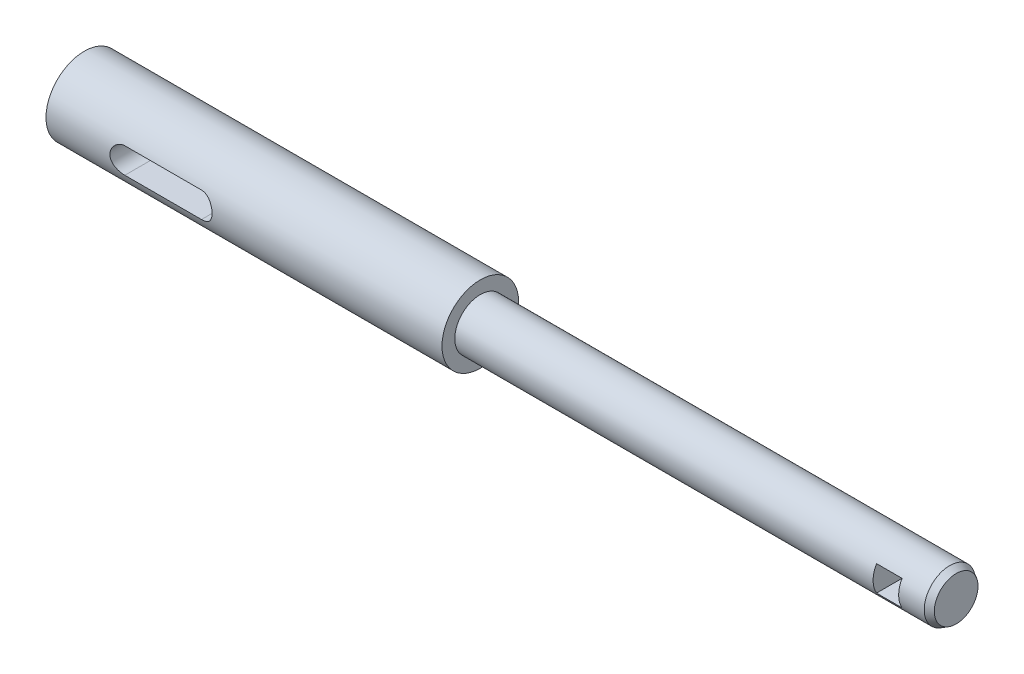
ISO-10303-21;
HEADER;
FILE_DESCRIPTION(('STEP AP214'),'2;1');
FILE_NAME('part.step','',(''),(''),'','','');
FILE_SCHEMA(('AUTOMOTIVE_DESIGN { 1 0 10303 214 1 1 1 1 }'));
ENDSEC;
DATA;
#1=APPLICATION_CONTEXT('core data for automotive mechanical design processes');
#2=APPLICATION_PROTOCOL_DEFINITION('international standard','automotive_design',2000,#1);
#3=PRODUCT_CONTEXT('',#1,'mechanical');
#4=PRODUCT('Part','Part','',(#3));
#5=PRODUCT_RELATED_PRODUCT_CATEGORY('part','',(#4));
#6=PRODUCT_DEFINITION_FORMATION('','',#4);
#7=PRODUCT_DEFINITION_CONTEXT('part definition',#1,'design');
#8=PRODUCT_DEFINITION('design','',#6,#7);
#9=PRODUCT_DEFINITION_SHAPE('','',#8);
#10=(LENGTH_UNIT() NAMED_UNIT(*) SI_UNIT(.MILLI.,.METRE.));
#11=(NAMED_UNIT(*) PLANE_ANGLE_UNIT() SI_UNIT($,.RADIAN.));
#12=(NAMED_UNIT(*) SI_UNIT($,.STERADIAN.) SOLID_ANGLE_UNIT());
#13=UNCERTAINTY_MEASURE_WITH_UNIT(LENGTH_MEASURE(1.E-05),#10,'distance_accuracy_value','');
#14=(GEOMETRIC_REPRESENTATION_CONTEXT(3) GLOBAL_UNCERTAINTY_ASSIGNED_CONTEXT((#13)) GLOBAL_UNIT_ASSIGNED_CONTEXT((#10,
#11,#12)) REPRESENTATION_CONTEXT('',''));
#15=CARTESIAN_POINT('',(0.,0.,0.));
#16=DIRECTION('',(0.,0.,1.));
#17=DIRECTION('',(1.,0.,0.));
#18=AXIS2_PLACEMENT_3D('',#15,#16,#17);
#19=CARTESIAN_POINT('',(31.,12.,0.));
#20=DIRECTION('',(1.,0.,0.));
#21=DIRECTION('',(0.,0.,-1.));
#22=AXIS2_PLACEMENT_3D('',#19,#20,#21);
#23=PLANE('',#22);
#24=CARTESIAN_POINT('',(31.,6.,0.));
#25=DIRECTION('',(1.,0.,0.));
#26=DIRECTION('',(0.,0.,-1.));
#27=AXIS2_PLACEMENT_3D('',#24,#25,#26);
#28=CIRCLE('',#27,4.);
#29=CARTESIAN_POINT('',(31.,6.,-4.));
#30=VERTEX_POINT('',#29);
#31=EDGE_CURVE('E144',#30,#30,#28,.T.);
#32=ORIENTED_EDGE('',*,*,#31,.F.);
#33=EDGE_LOOP('',(#32));
#34=FACE_BOUND('',#33,.T.);
#35=CARTESIAN_POINT('',(31.,6.,0.));
#36=DIRECTION('',(1.,0.,0.));
#37=DIRECTION('',(0.,0.,-1.));
#38=AXIS2_PLACEMENT_3D('',#35,#36,#37);
#39=CIRCLE('',#38,6.);
#40=CARTESIAN_POINT('',(31.,6.,-6.));
#41=VERTEX_POINT('',#40);
#42=EDGE_CURVE('E150',#41,#41,#39,.T.);
#43=ORIENTED_EDGE('',*,*,#42,.T.);
#44=EDGE_LOOP('',(#43));
#45=FACE_BOUND('',#44,.T.);
#46=ADVANCED_FACE('F48',(#34,#45),#23,.T.);
#47=CARTESIAN_POINT('',(105.5,6.,0.));
#48=DIRECTION('',(-1.,0.,0.));
#49=DIRECTION('',(0.,0.,1.));
#50=AXIS2_PLACEMENT_3D('',#47,#48,#49);
#51=CYLINDRICAL_SURFACE('',#50,4.);
#52=CARTESIAN_POINT('',(104.5,6.,0.));
#53=DIRECTION('',(1.,0.,0.));
#54=DIRECTION('',(0.,0.,-1.));
#55=AXIS2_PLACEMENT_3D('',#52,#53,#54);
#56=CIRCLE('',#55,4.);
#57=CARTESIAN_POINT('',(104.5,6.,-4.));
#58=VERTEX_POINT('',#57);
#59=EDGE_CURVE('E12',#58,#58,#56,.F.);
#60=ORIENTED_EDGE('',*,*,#59,.T.);
#61=EDGE_LOOP('',(#60));
#62=FACE_BOUND('',#61,.T.);
#63=DIRECTION('',(-1.,0.,0.));
#64=VECTOR('',#63,1.);
#65=CARTESIAN_POINT('',(105.5,3.99999999999999,-3.46410161513775));
#66=LINE('',#65,#64);
#67=CARTESIAN_POINT('',(96.5,3.99999999999999,-3.46410161513775));
#68=VERTEX_POINT('',#67);
#69=CARTESIAN_POINT('',(100.5,3.99999999999999,-3.46410161513775));
#70=VERTEX_POINT('',#69);
#71=EDGE_CURVE('E237',#68,#70,#66,.F.);
#72=ORIENTED_EDGE('',*,*,#71,.T.);
#73=CARTESIAN_POINT('',(100.5,6.,0.));
#74=DIRECTION('',(1.,0.,0.));
#75=DIRECTION('',(0.,0.,-1.));
#76=AXIS2_PLACEMENT_3D('',#73,#74,#75);
#77=CIRCLE('',#76,4.);
#78=CARTESIAN_POINT('',(100.5,8.00000000000001,-3.46410161513775));
#79=VERTEX_POINT('',#78);
#80=EDGE_CURVE('E234',#70,#79,#77,.T.);
#81=ORIENTED_EDGE('',*,*,#80,.T.);
#82=DIRECTION('',(-1.,0.,0.));
#83=VECTOR('',#82,1.);
#84=CARTESIAN_POINT('',(105.5,8.00000000000001,-3.46410161513775));
#85=LINE('',#84,#83);
#86=CARTESIAN_POINT('',(96.5,8.00000000000001,-3.46410161513775));
#87=VERTEX_POINT('',#86);
#88=EDGE_CURVE('E245',#79,#87,#85,.T.);
#89=ORIENTED_EDGE('',*,*,#88,.T.);
#90=CARTESIAN_POINT('',(96.5,6.,0.));
#91=DIRECTION('',(-1.,0.,0.));
#92=DIRECTION('',(0.,0.,1.));
#93=AXIS2_PLACEMENT_3D('',#90,#91,#92);
#94=CIRCLE('',#93,4.);
#95=EDGE_CURVE('E244',#87,#68,#94,.T.);
#96=ORIENTED_EDGE('',*,*,#95,.T.);
#97=EDGE_LOOP('',(#72,#81,#89,#96));
#98=FACE_BOUND('',#97,.T.);
#99=DIRECTION('',(-1.,0.,0.));
#100=VECTOR('',#99,1.);
#101=CARTESIAN_POINT('',(105.5,8.00000000000001,3.46410161513775));
#102=LINE('',#101,#100);
#103=CARTESIAN_POINT('',(96.5,8.00000000000001,3.46410161513774));
#104=VERTEX_POINT('',#103);
#105=CARTESIAN_POINT('',(100.5,8.00000000000001,3.46410161513775));
#106=VERTEX_POINT('',#105);
#107=EDGE_CURVE('E259',#104,#106,#102,.F.);
#108=ORIENTED_EDGE('',*,*,#107,.T.);
#109=CARTESIAN_POINT('',(100.5,3.99999999999999,3.46410161513774));
#110=VERTEX_POINT('',#109);
#111=EDGE_CURVE('E239',#106,#110,#77,.T.);
#112=ORIENTED_EDGE('',*,*,#111,.T.);
#113=DIRECTION('',(-1.,0.,0.));
#114=VECTOR('',#113,1.);
#115=CARTESIAN_POINT('',(105.5,3.99999999999999,3.46410161513775));
#116=LINE('',#115,#114);
#117=CARTESIAN_POINT('',(96.5,3.99999999999999,3.46410161513775));
#118=VERTEX_POINT('',#117);
#119=EDGE_CURVE('E251',#110,#118,#116,.T.);
#120=ORIENTED_EDGE('',*,*,#119,.T.);
#121=EDGE_CURVE('E255',#118,#104,#94,.T.);
#122=ORIENTED_EDGE('',*,*,#121,.T.);
#123=EDGE_LOOP('',(#108,#112,#120,#122));
#124=FACE_BOUND('',#123,.T.);
#125=ORIENTED_EDGE('',*,*,#31,.T.);
#126=EDGE_LOOP('',(#125));
#127=FACE_BOUND('',#126,.T.);
#128=ADVANCED_FACE('F212',(#62,#98,#124,#127),#51,.T.);
#129=CARTESIAN_POINT('',(105.5,6.,0.));
#130=DIRECTION('',(1.,0.,0.));
#131=DIRECTION('',(0.,0.,-1.));
#132=AXIS2_PLACEMENT_3D('',#129,#130,#131);
#133=PLANE('',#132);
#134=CARTESIAN_POINT('',(105.5,6.,0.));
#135=DIRECTION('',(1.,0.,0.));
#136=DIRECTION('',(0.,0.,-1.));
#137=AXIS2_PLACEMENT_3D('',#134,#135,#136);
#138=CIRCLE('',#137,3.42264973081038);
#139=CARTESIAN_POINT('',(105.5,6.,-3.42264973081038));
#140=VERTEX_POINT('',#139);
#141=EDGE_CURVE('E58',#140,#140,#138,.T.);
#142=ORIENTED_EDGE('',*,*,#141,.T.);
#143=EDGE_LOOP('',(#142));
#144=FACE_BOUND('',#143,.T.);
#145=ADVANCED_FACE('F217',(#144),#133,.T.);
#146=CARTESIAN_POINT('',(105.5,6.,0.));
#147=DIRECTION('',(-1.,0.,0.));
#148=DIRECTION('',(0.,0.,1.));
#149=AXIS2_PLACEMENT_3D('',#146,#147,#148);
#150=CYLINDRICAL_SURFACE('',#149,6.);
#151=CARTESIAN_POINT('',(-17.,6.,6.));
#152=CARTESIAN_POINT('',(-16.9999994925368,6.10912672577345,6.00000030601888));
#153=CARTESIAN_POINT('',(-17.0089605322544,6.2182503890771,5.9969953901509));
#154=CARTESIAN_POINT('',(-17.0444582176344,6.43328352174595,5.98530420406562));
#155=CARTESIAN_POINT('',(-17.0709966878978,6.53919265623764,5.97661734404305));
#156=CARTESIAN_POINT('',(-17.1406384867681,6.74466557900355,5.95450615812885));
#157=CARTESIAN_POINT('',(-17.1837141249186,6.84423965177207,5.94108975461707));
#158=CARTESIAN_POINT('',(-17.2850823456767,7.03474987361065,5.91088891434684));
#159=CARTESIAN_POINT('',(-17.3433779300052,7.12568431391741,5.89410381335556));
#160=CARTESIAN_POINT('',(-17.4756516097175,7.29948335004453,5.8582818888601));
#161=CARTESIAN_POINT('',(-17.550062468521,7.38200740059662,5.8391911292757));
#162=CARTESIAN_POINT('',(-17.7115343094131,7.53366538540417,5.80120629566243));
#163=CARTESIAN_POINT('',(-17.798598069857,7.60279637097892,5.78231226581098));
#164=CARTESIAN_POINT('',(-17.9859702303929,7.72764988445572,5.74626664954548));
#165=CARTESIAN_POINT('',(-18.0865874794642,7.78292971644206,5.72918078551376));
#166=CARTESIAN_POINT('',(-18.2963521889171,7.87563774775544,5.69950610837202));
#167=CARTESIAN_POINT('',(-18.4054970343255,7.91307139477353,5.68691592321491));
#168=CARTESIAN_POINT('',(-18.6253464429934,7.96774692301833,5.66822606538755));
#169=CARTESIAN_POINT('',(-18.7358744169781,7.98562689654354,5.66192191539223));
#170=CARTESIAN_POINT('',(-18.9585275083118,8.00268224666895,5.65591313259015));
#171=CARTESIAN_POINT('',(-19.0706521214184,8.00186340320944,5.6562064604546));
#172=CARTESIAN_POINT('',(-19.287873260888,7.98203980740684,5.6631803001636));
#173=CARTESIAN_POINT('',(-19.393056805838,7.96386782633399,5.66956831735066));
#174=CARTESIAN_POINT('',(-19.5987868392137,7.91121232569883,5.68753315449102));
#175=CARTESIAN_POINT('',(-19.6993327708701,7.87672685318374,5.69911059568215));
#176=CARTESIAN_POINT('',(-19.894825499183,7.79187811612042,5.72635822262498));
#177=CARTESIAN_POINT('',(-19.9896560509391,7.74126809741453,5.74209131586235));
#178=CARTESIAN_POINT('',(-20.1697418165595,7.62577821260628,5.77585117151453));
#179=CARTESIAN_POINT('',(-20.2549942538668,7.56089422472801,5.79387859580927));
#180=CARTESIAN_POINT('',(-20.4181831963216,7.41469866536448,5.83134658335482));
#181=CARTESIAN_POINT('',(-20.4955053890181,7.33270630015263,5.85081178709686));
#182=CARTESIAN_POINT('',(-20.6354625333268,7.15667913994013,5.88813876774073));
#183=CARTESIAN_POINT('',(-20.698096076329,7.06264319132163,5.90600039076135));
#184=CARTESIAN_POINT('',(-20.8073926004701,6.86389522609254,5.93834215875587));
#185=CARTESIAN_POINT('',(-20.8538909826815,6.75908655283268,5.95278700016078));
#186=CARTESIAN_POINT('',(-20.9284063479114,6.54253816672902,5.9764113428887));
#187=CARTESIAN_POINT('',(-20.9564297508469,6.43080087630991,5.98559267309759));
#188=CARTESIAN_POINT('',(-20.9921113320447,6.20876765905861,5.99735254142881));
#189=CARTESIAN_POINT('',(-21.0005996183455,6.0986191997297,6.00020003667456));
#190=CARTESIAN_POINT('',(-20.9993346528031,5.87844986007953,5.99977805389655));
#191=CARTESIAN_POINT('',(-20.9895844800403,5.7684289613607,5.99650960838725));
#192=CARTESIAN_POINT('',(-20.9527761845281,5.55496026739149,5.98440049434209));
#193=CARTESIAN_POINT('',(-20.926227587901,5.45141438633032,5.97572397422385));
#194=CARTESIAN_POINT('',(-20.8572131110665,5.25028808284086,5.9538369366014));
#195=CARTESIAN_POINT('',(-20.8147452010644,5.15270842298279,5.9406258409335));
#196=CARTESIAN_POINT('',(-20.7138591363184,4.96342340721346,5.9105786257458));
#197=CARTESIAN_POINT('',(-20.6550508134337,4.87194008156571,5.89365629511572));
#198=CARTESIAN_POINT('',(-20.523611699973,4.69987033972883,5.85810507832525));
#199=CARTESIAN_POINT('',(-20.4509766879365,4.61928726440885,5.83947567187655));
#200=CARTESIAN_POINT('',(-20.2900424979868,4.46749498438741,5.8015369596089));
#201=CARTESIAN_POINT('',(-20.2011815461463,4.39687806150846,5.78223522174856));
#202=CARTESIAN_POINT('',(-20.0124568643782,4.27148495535285,5.74599946589418));
#203=CARTESIAN_POINT('',(-19.9125930427319,4.21670890413798,5.72906546764005));
#204=CARTESIAN_POINT('',(-19.7046539694202,4.12480613916728,5.69964783582767));
#205=CARTESIAN_POINT('',(-19.5965958416625,4.08764373566996,5.68715521585958));
#206=CARTESIAN_POINT('',(-19.3752426999118,4.03221066648129,5.66821664612899));
#207=CARTESIAN_POINT('',(-19.2619500691913,4.01393149009212,5.66176797247279));
#208=CARTESIAN_POINT('',(-19.0396058079182,3.99744743504532,5.65595717748355));
#209=CARTESIAN_POINT('',(-18.9306353194264,3.9982594853832,5.65624800514831));
#210=CARTESIAN_POINT('',(-18.7144698501559,4.01751541310262,5.66302539647735));
#211=CARTESIAN_POINT('',(-18.6072747640898,4.03595824108283,5.66951159138724));
#212=CARTESIAN_POINT('',(-18.3997286739951,4.08925637374131,5.68769048609784));
#213=CARTESIAN_POINT('',(-18.299286349991,4.12379330796897,5.69928196044955));
#214=CARTESIAN_POINT('',(-18.1055451861235,4.20804126848051,5.72632797636937));
#215=CARTESIAN_POINT('',(-18.012247937624,4.25775566289239,5.74178337526786));
#216=CARTESIAN_POINT('',(-17.8310326601542,4.37347861483314,5.77565658452093));
#217=CARTESIAN_POINT('',(-17.7435269962032,4.44010351447084,5.79417423284274));
#218=CARTESIAN_POINT('',(-17.5806203732316,4.5867142337287,5.83166712566506));
#219=CARTESIAN_POINT('',(-17.5052228486239,4.66670383109704,5.85064249824745));
#220=CARTESIAN_POINT('',(-17.3657111754217,4.84151688615863,5.88780061051088));
#221=CARTESIAN_POINT('',(-17.302151304498,4.93679697300054,5.90592363602513));
#222=CARTESIAN_POINT('',(-17.1920191422987,5.13728528518675,5.93851982345224));
#223=CARTESIAN_POINT('',(-17.1454425081559,5.2424909637353,5.9529939181586));
#224=CARTESIAN_POINT('',(-17.0725567350227,5.45501270559805,5.97611030137084));
#225=CARTESIAN_POINT('',(-17.0454350674732,5.56202448464718,5.98498424845045));
#226=CARTESIAN_POINT('',(-17.0091594386458,5.7793591679795,5.99692814128444));
#227=CARTESIAN_POINT('',(-17.000000513007,5.88968114886251,5.9999996906381));
#228=CARTESIAN_POINT('',(-17.,6.,6.));
#229=B_SPLINE_CURVE_WITH_KNOTS('',3,(#151,#152,#153,#154,#155,#156,#157,#158,#159,#160,#161,
#162,#163,#164,#165,#166,#167,#168,#169,#170,#171,#172,#173,#174,#175,#176,#177,#178,#179,#180,
#181,#182,#183,#184,#185,#186,#187,#188,#189,#190,#191,#192,#193,#194,#195,#196,#197,#198,#199,
#200,#201,#202,#203,#204,#205,#206,#207,#208,#209,#210,#211,#212,#213,#214,#215,#216,#217,#218,
#219,#220,#221,#222,#223,#224,#225,#226,#227,#228),.UNSPECIFIED.,.T.,.F.,(4,2,2,2,2,2,2,2,2,2,2,
2,2,2,2,2,2,2,2,2,2,2,2,2,2,2,2,2,2,2,2,2,2,2,2,2,2,2,4),(0.,0.326974212052022,
0.653982370535038,0.980445345740542,1.3069727555982,1.64369368565512,1.9804886657506,
2.32696769646941,2.67334089385667,3.00803851483679,3.3426326797497,3.6619365310256,
3.98127861710964,4.3057634231026,4.63034205116414,4.97186611622733,5.31342291933236,
5.65836811300714,6.00319337754416,6.33307166350338,6.66289426328352,6.98316315956426,
7.30347290568207,7.63220799687472,7.96104361643781,8.30482045761503,8.64860016469992,
8.99168027653539,9.33460569411679,9.65991332128516,9.9852015870275,10.3043117416083,
10.6234927635195,10.9566013338361,11.2898042224756,11.635993216702,11.9820936230491,
12.3127311674763,12.6432773207628),.UNSPECIFIED.);
#230=CARTESIAN_POINT('',(-19.,8.,5.65685424949238));
#231=VERTEX_POINT('',#230);
#232=CARTESIAN_POINT('',(-18.9999999999992,3.99999999999941,5.65685424949225));
#233=VERTEX_POINT('',#232);
#234=EDGE_CURVE('E127',#231,#233,#229,.T.);
#235=ORIENTED_EDGE('',*,*,#234,.F.);
#236=DIRECTION('',(-1.,0.,0.));
#237=VECTOR('',#236,1.);
#238=CARTESIAN_POINT('',(105.5,8.,5.65685424949238));
#239=LINE('',#238,#237);
#240=CARTESIAN_POINT('',(-7.00000000000001,8.,5.65685424949238));
#241=VERTEX_POINT('',#240);
#242=EDGE_CURVE('E142',#241,#231,#239,.T.);
#243=ORIENTED_EDGE('',*,*,#242,.F.);
#244=CARTESIAN_POINT('',(-5.00000000000004,6.,6.));
#245=CARTESIAN_POINT('',(-4.99999949253675,6.10912672577345,6.00000030601888));
#246=CARTESIAN_POINT('',(-5.00896053225445,6.2182503890771,5.9969953901509));
#247=CARTESIAN_POINT('',(-5.04445821763444,6.43328352174595,5.98530420406562));
#248=CARTESIAN_POINT('',(-5.07099668789785,6.53919265623764,5.97661734404305));
#249=CARTESIAN_POINT('',(-5.14063848676811,6.74466557900355,5.95450615812885));
#250=CARTESIAN_POINT('',(-5.18371412491855,6.84423965177207,5.94108975461707));
#251=CARTESIAN_POINT('',(-5.2850823456767,7.03474987361065,5.91088891434684));
#252=CARTESIAN_POINT('',(-5.34337793000521,7.12568431391741,5.89410381335556));
#253=CARTESIAN_POINT('',(-5.47565160971751,7.29948335004453,5.8582818888601));
#254=CARTESIAN_POINT('',(-5.55006246852099,7.38200740059662,5.8391911292757));
#255=CARTESIAN_POINT('',(-5.71153430941314,7.53366538540417,5.80120629566243));
#256=CARTESIAN_POINT('',(-5.79859806985703,7.60279637097892,5.78231226581098));
#257=CARTESIAN_POINT('',(-5.98597023039292,7.72764988445572,5.74626664954548));
#258=CARTESIAN_POINT('',(-6.08658747946425,7.78292971644206,5.72918078551376));
#259=CARTESIAN_POINT('',(-6.2963521889171,7.87563774775544,5.69950610837202));
#260=CARTESIAN_POINT('',(-6.40549703432549,7.91307139477353,5.68691592321491));
#261=CARTESIAN_POINT('',(-6.62534644299343,7.96774692301833,5.66822606538755));
#262=CARTESIAN_POINT('',(-6.73587441697813,7.98562689654354,5.66192191539223));
#263=CARTESIAN_POINT('',(-6.95852750831177,8.00268224666895,5.65591313259015));
#264=CARTESIAN_POINT('',(-7.07065212141839,8.00186340320944,5.6562064604546));
#265=CARTESIAN_POINT('',(-7.28787326088805,7.98203980740684,5.6631803001636));
#266=CARTESIAN_POINT('',(-7.39305680583804,7.96386782633399,5.66956831735066));
#267=CARTESIAN_POINT('',(-7.59878683921367,7.91121232569883,5.68753315449102));
#268=CARTESIAN_POINT('',(-7.69933277087014,7.87672685318374,5.69911059568215));
#269=CARTESIAN_POINT('',(-7.89482549918296,7.79187811612042,5.72635822262498));
#270=CARTESIAN_POINT('',(-7.98965605093905,7.74126809741453,5.74209131586235));
#271=CARTESIAN_POINT('',(-8.16974181655945,7.62577821260628,5.77585117151453));
#272=CARTESIAN_POINT('',(-8.25499425386677,7.56089422472801,5.79387859580927));
#273=CARTESIAN_POINT('',(-8.41818319632155,7.41469866536448,5.83134658335482));
#274=CARTESIAN_POINT('',(-8.49550538901814,7.33270630015263,5.85081178709686));
#275=CARTESIAN_POINT('',(-8.6354625333268,7.15667913994013,5.88813876774073));
#276=CARTESIAN_POINT('',(-8.69809607632899,7.06264319132163,5.90600039076135));
#277=CARTESIAN_POINT('',(-8.80739260047014,6.86389522609254,5.93834215875587));
#278=CARTESIAN_POINT('',(-8.85389098268147,6.75908655283268,5.95278700016078));
#279=CARTESIAN_POINT('',(-8.92840634791142,6.54253816672902,5.9764113428887));
#280=CARTESIAN_POINT('',(-8.95642975084688,6.43080087630991,5.98559267309759));
#281=CARTESIAN_POINT('',(-8.99211133204472,6.20876765905861,5.99735254142881));
#282=CARTESIAN_POINT('',(-9.00059961834551,6.0986191997297,6.00020003667456));
#283=CARTESIAN_POINT('',(-8.99933465280307,5.87844986007953,5.99977805389655));
#284=CARTESIAN_POINT('',(-8.98958448004025,5.7684289613607,5.99650960838725));
#285=CARTESIAN_POINT('',(-8.95277618452809,5.55496026739149,5.98440049434209));
#286=CARTESIAN_POINT('',(-8.92622758790102,5.45141438633032,5.97572397422385));
#287=CARTESIAN_POINT('',(-8.85721311106655,5.25028808284086,5.9538369366014));
#288=CARTESIAN_POINT('',(-8.81474520106443,5.15270842298279,5.9406258409335));
#289=CARTESIAN_POINT('',(-8.71385913631843,4.96342340721346,5.9105786257458));
#290=CARTESIAN_POINT('',(-8.65505081343366,4.87194008156571,5.89365629511572));
#291=CARTESIAN_POINT('',(-8.52361169997304,4.69987033972883,5.85810507832525));
#292=CARTESIAN_POINT('',(-8.45097668793647,4.61928726440885,5.83947567187655));
#293=CARTESIAN_POINT('',(-8.29004249798683,4.4674949843874,5.8015369596089));
#294=CARTESIAN_POINT('',(-8.20118154614628,4.39687806150846,5.78223522174856));
#295=CARTESIAN_POINT('',(-8.01245686437823,4.27148495535285,5.74599946589418));
#296=CARTESIAN_POINT('',(-7.91259304273186,4.21670890413798,5.72906546764005));
#297=CARTESIAN_POINT('',(-7.70465396942022,4.12480613916728,5.69964783582767));
#298=CARTESIAN_POINT('',(-7.59659584166248,4.08764373566996,5.68715521585958));
#299=CARTESIAN_POINT('',(-7.37524269991175,4.03221066648129,5.66821664612899));
#300=CARTESIAN_POINT('',(-7.26195006919131,4.01393149009212,5.66176797247279));
#301=CARTESIAN_POINT('',(-7.03960580791817,3.99744743504532,5.65595717748355));
#302=CARTESIAN_POINT('',(-6.93063531942636,3.9982594853832,5.65624800514831));
#303=CARTESIAN_POINT('',(-6.71446985015588,4.01751541310262,5.66302539647735));
#304=CARTESIAN_POINT('',(-6.60727476408983,4.03595824108283,5.66951159138724));
#305=CARTESIAN_POINT('',(-6.39972867399506,4.08925637374131,5.68769048609784));
#306=CARTESIAN_POINT('',(-6.29928634999101,4.12379330796897,5.69928196044955));
#307=CARTESIAN_POINT('',(-6.10554518612347,4.20804126848051,5.72632797636937));
#308=CARTESIAN_POINT('',(-6.01224793762399,4.25775566289239,5.74178337526786));
#309=CARTESIAN_POINT('',(-5.83103266015419,4.37347861483314,5.77565658452093));
#310=CARTESIAN_POINT('',(-5.74352699620324,4.44010351447084,5.79417423284274));
#311=CARTESIAN_POINT('',(-5.58062037323161,4.5867142337287,5.83166712566506));
#312=CARTESIAN_POINT('',(-5.50522284862386,4.66670383109704,5.85064249824745));
#313=CARTESIAN_POINT('',(-5.36571117542165,4.84151688615863,5.88780061051088));
#314=CARTESIAN_POINT('',(-5.30215130449801,4.93679697300055,5.90592363602513));
#315=CARTESIAN_POINT('',(-5.19201914229872,5.13728528518675,5.93851982345224));
#316=CARTESIAN_POINT('',(-5.14544250815593,5.2424909637353,5.9529939181586));
#317=CARTESIAN_POINT('',(-5.07255673502266,5.45501270559805,5.97611030137084));
#318=CARTESIAN_POINT('',(-5.04543506747325,5.56202448464718,5.98498424845045));
#319=CARTESIAN_POINT('',(-5.00915943864576,5.7793591679795,5.99692814128444));
#320=CARTESIAN_POINT('',(-5.00000051300696,5.88968114886251,5.9999996906381));
#321=CARTESIAN_POINT('',(-5.00000000000004,6.,6.));
#322=B_SPLINE_CURVE_WITH_KNOTS('',3,(#244,#245,#246,#247,#248,#249,#250,#251,#252,#253,#254,
#255,#256,#257,#258,#259,#260,#261,#262,#263,#264,#265,#266,#267,#268,#269,#270,#271,#272,#273,
#274,#275,#276,#277,#278,#279,#280,#281,#282,#283,#284,#285,#286,#287,#288,#289,#290,#291,#292,
#293,#294,#295,#296,#297,#298,#299,#300,#301,#302,#303,#304,#305,#306,#307,#308,#309,#310,#311,
#312,#313,#314,#315,#316,#317,#318,#319,#320,#321),.UNSPECIFIED.,.T.,.F.,(4,2,2,2,2,2,2,2,2,2,2,
2,2,2,2,2,2,2,2,2,2,2,2,2,2,2,2,2,2,2,2,2,2,2,2,2,2,2,4),(0.,0.326974212052022,
0.653982370535038,0.980445345740542,1.3069727555982,1.64369368565512,1.9804886657506,
2.3269676964694,2.67334089385666,3.0080385148368,3.3426326797497,3.6619365310256,
3.98127861710963,4.30576342310261,4.63034205116414,4.97186611622733,5.31342291933236,
5.65836811300714,6.00319337754416,6.33307166350338,6.66289426328352,6.98316315956426,
7.30347290568207,7.63220799687472,7.96104361643781,8.30482045761503,8.64860016469992,
8.9916802765354,9.33460569411679,9.65991332128515,9.98520158702749,10.3043117416083,
10.6234927635195,10.9566013338361,11.2898042224756,11.635993216702,11.9820936230491,
12.3127311674763,12.6432773207628),.UNSPECIFIED.);
#323=CARTESIAN_POINT('',(-7.00000000000001,4.,5.65685424949238));
#324=VERTEX_POINT('',#323);
#325=EDGE_CURVE('E132',#324,#241,#322,.T.);
#326=ORIENTED_EDGE('',*,*,#325,.F.);
#327=DIRECTION('',(-1.,0.,0.));
#328=VECTOR('',#327,1.);
#329=CARTESIAN_POINT('',(105.5,4.,5.65685424949238));
#330=LINE('',#329,#328);
#331=EDGE_CURVE('E114',#233,#324,#330,.F.);
#332=ORIENTED_EDGE('',*,*,#331,.F.);
#333=EDGE_LOOP('',(#235,#243,#326,#332));
#334=FACE_BOUND('',#333,.T.);
#335=DIRECTION('',(-1.,0.,0.));
#336=VECTOR('',#335,1.);
#337=CARTESIAN_POINT('',(105.5,4.,-5.65685424949238));
#338=LINE('',#337,#336);
#339=CARTESIAN_POINT('',(-7.00000000000001,4.,-5.65685424949238));
#340=VERTEX_POINT('',#339);
#341=CARTESIAN_POINT('',(-19.,4.,-5.65685424949238));
#342=VERTEX_POINT('',#341);
#343=EDGE_CURVE('E186',#340,#342,#338,.T.);
#344=ORIENTED_EDGE('',*,*,#343,.F.);
#345=CARTESIAN_POINT('',(-5.00000000000001,6.,-6.));
#346=CARTESIAN_POINT('',(-4.99999949253673,5.89087327422656,-6.00000030601888));
#347=CARTESIAN_POINT('',(-5.00896053225444,5.7817496109229,-5.9969953901509));
#348=CARTESIAN_POINT('',(-5.04445821763445,5.56671647825406,-5.98530420406562));
#349=CARTESIAN_POINT('',(-5.07099668789785,5.46080734376237,-5.97661734404305));
#350=CARTESIAN_POINT('',(-5.1406384867681,5.25533442099645,-5.95450615812885));
#351=CARTESIAN_POINT('',(-5.18371412491855,5.15576034822793,-5.94108975461707));
#352=CARTESIAN_POINT('',(-5.2850823456767,4.96525012638935,-5.91088891434684));
#353=CARTESIAN_POINT('',(-5.34337793000521,4.87431568608259,-5.89410381335556));
#354=CARTESIAN_POINT('',(-5.47565160971751,4.70051664995547,-5.8582818888601));
#355=CARTESIAN_POINT('',(-5.55006246852099,4.61799259940338,-5.8391911292757));
#356=CARTESIAN_POINT('',(-5.71153430941314,4.46633461459584,-5.80120629566243));
#357=CARTESIAN_POINT('',(-5.79859806985703,4.39720362902108,-5.78231226581098));
#358=CARTESIAN_POINT('',(-5.98597023039293,4.27235011554429,-5.74626664954548));
#359=CARTESIAN_POINT('',(-6.08658747946425,4.21707028355794,-5.72918078551376));
#360=CARTESIAN_POINT('',(-6.2963521889171,4.12436225224456,-5.69950610837202));
#361=CARTESIAN_POINT('',(-6.40549703432549,4.08692860522647,-5.68691592321491));
#362=CARTESIAN_POINT('',(-6.62534644299343,4.03225307698168,-5.66822606538755));
#363=CARTESIAN_POINT('',(-6.73587441697814,4.01437310345646,-5.66192191539223));
#364=CARTESIAN_POINT('',(-6.95852750831177,3.99731775333105,-5.65591313259015));
#365=CARTESIAN_POINT('',(-7.07065212141839,3.99813659679057,-5.6562064604546));
#366=CARTESIAN_POINT('',(-7.28787326088805,4.01796019259317,-5.66318030016361));
#367=CARTESIAN_POINT('',(-7.39305680583804,4.03613217366602,-5.66956831735066));
#368=CARTESIAN_POINT('',(-7.59878683921368,4.08878767430117,-5.68753315449102));
#369=CARTESIAN_POINT('',(-7.69933277087015,4.12327314681626,-5.69911059568215));
#370=CARTESIAN_POINT('',(-7.89482549918296,4.20812188387958,-5.72635822262498));
#371=CARTESIAN_POINT('',(-7.98965605093906,4.25873190258548,-5.74209131586235));
#372=CARTESIAN_POINT('',(-8.16974181655946,4.37422178739373,-5.77585117151453));
#373=CARTESIAN_POINT('',(-8.25499425386677,4.43910577527199,-5.79387859580927));
#374=CARTESIAN_POINT('',(-8.41818319632155,4.58530133463553,-5.83134658335482));
#375=CARTESIAN_POINT('',(-8.49550538901815,4.66729369984738,-5.85081178709686));
#376=CARTESIAN_POINT('',(-8.6354625333268,4.84332086005988,-5.88813876774073));
#377=CARTESIAN_POINT('',(-8.698096076329,4.93735680867837,-5.90600039076135));
#378=CARTESIAN_POINT('',(-8.80739260047014,5.13610477390747,-5.93834215875587));
#379=CARTESIAN_POINT('',(-8.85389098268147,5.24091344716733,-5.95278700016079));
#380=CARTESIAN_POINT('',(-8.92840634791143,5.45746183327099,-5.9764113428887));
#381=CARTESIAN_POINT('',(-8.95642975084688,5.56919912369009,-5.98559267309759));
#382=CARTESIAN_POINT('',(-8.99211133204472,5.79123234094139,-5.99735254142881));
#383=CARTESIAN_POINT('',(-9.00059961834551,5.90138080027031,-6.00020003667456));
#384=CARTESIAN_POINT('',(-8.99933465280307,6.12155013992048,-5.99977805389655));
#385=CARTESIAN_POINT('',(-8.98958448004025,6.2315710386393,-5.99650960838725));
#386=CARTESIAN_POINT('',(-8.95277618452809,6.44503973260851,-5.98440049434209));
#387=CARTESIAN_POINT('',(-8.92622758790102,6.54858561366969,-5.97572397422385));
#388=CARTESIAN_POINT('',(-8.85721311106655,6.74971191715915,-5.9538369366014));
#389=CARTESIAN_POINT('',(-8.81474520106443,6.84729157701722,-5.9406258409335));
#390=CARTESIAN_POINT('',(-8.71385913631843,7.03657659278655,-5.91057862574579));
#391=CARTESIAN_POINT('',(-8.65505081343366,7.1280599184343,-5.89365629511572));
#392=CARTESIAN_POINT('',(-8.52361169997304,7.30012966027118,-5.85810507832525));
#393=CARTESIAN_POINT('',(-8.45097668793647,7.38071273559116,-5.83947567187655));
#394=CARTESIAN_POINT('',(-8.29004249798683,7.5325050156126,-5.80153695960889));
#395=CARTESIAN_POINT('',(-8.20118154614628,7.60312193849154,-5.78223522174856));
#396=CARTESIAN_POINT('',(-8.01245686437823,7.72851504464715,-5.74599946589417));
#397=CARTESIAN_POINT('',(-7.91259304273185,7.78329109586203,-5.72906546764005));
#398=CARTESIAN_POINT('',(-7.70465396942021,7.87519386083272,-5.69964783582767));
#399=CARTESIAN_POINT('',(-7.59659584166247,7.91235626433004,-5.68715521585958));
#400=CARTESIAN_POINT('',(-7.37524269991174,7.96778933351871,-5.66821664612899));
#401=CARTESIAN_POINT('',(-7.26195006919131,7.98606850990788,-5.66176797247279));
#402=CARTESIAN_POINT('',(-7.03960580791817,8.00255256495469,-5.65595717748354));
#403=CARTESIAN_POINT('',(-6.93063531942636,8.0017405146168,-5.6562480051483));
#404=CARTESIAN_POINT('',(-6.71446985015588,7.98248458689738,-5.66302539647735));
#405=CARTESIAN_POINT('',(-6.60727476408983,7.96404175891717,-5.66951159138723));
#406=CARTESIAN_POINT('',(-6.39972867399506,7.91074362625869,-5.68769048609783));
#407=CARTESIAN_POINT('',(-6.29928634999101,7.87620669203103,-5.69928196044955));
#408=CARTESIAN_POINT('',(-6.10554518612347,7.79195873151949,-5.72632797636937));
#409=CARTESIAN_POINT('',(-6.01224793762399,7.74224433710761,-5.74178337526786));
#410=CARTESIAN_POINT('',(-5.83103266015418,7.62652138516686,-5.77565658452093));
#411=CARTESIAN_POINT('',(-5.74352699620323,7.55989648552916,-5.79417423284274));
#412=CARTESIAN_POINT('',(-5.58062037323161,7.4132857662713,-5.83166712566506));
#413=CARTESIAN_POINT('',(-5.50522284862386,7.33329616890296,-5.85064249824745));
#414=CARTESIAN_POINT('',(-5.36571117542165,7.15848311384138,-5.88780061051088));
#415=CARTESIAN_POINT('',(-5.30215130449801,7.06320302699946,-5.90592363602513));
#416=CARTESIAN_POINT('',(-5.19201914229872,6.86271471481325,-5.93851982345224));
#417=CARTESIAN_POINT('',(-5.14544250815592,6.7575090362647,-5.9529939181586));
#418=CARTESIAN_POINT('',(-5.07255673502266,6.54498729440195,-5.97611030137084));
#419=CARTESIAN_POINT('',(-5.04543506747326,6.43797551535282,-5.98498424845045));
#420=CARTESIAN_POINT('',(-5.00915943864576,6.2206408320205,-5.99692814128444));
#421=CARTESIAN_POINT('',(-5.00000051300693,6.1103188511375,-5.9999996906381));
#422=CARTESIAN_POINT('',(-5.00000000000001,6.,-6.));
#423=B_SPLINE_CURVE_WITH_KNOTS('',3,(#345,#346,#347,#348,#349,#350,#351,#352,#353,#354,#355,
#356,#357,#358,#359,#360,#361,#362,#363,#364,#365,#366,#367,#368,#369,#370,#371,#372,#373,#374,
#375,#376,#377,#378,#379,#380,#381,#382,#383,#384,#385,#386,#387,#388,#389,#390,#391,#392,#393,
#394,#395,#396,#397,#398,#399,#400,#401,#402,#403,#404,#405,#406,#407,#408,#409,#410,#411,#412,
#413,#414,#415,#416,#417,#418,#419,#420,#421,#422),.UNSPECIFIED.,.T.,.F.,(4,2,2,2,2,2,2,2,2,2,2,
2,2,2,2,2,2,2,2,2,2,2,2,2,2,2,2,2,2,2,2,2,2,2,2,2,2,2,4),(0.,0.326974212052022,
0.653982370535041,0.980445345740548,1.3069727555982,1.64369368565512,1.9804886657506,
2.32696769646941,2.67334089385666,3.0080385148368,3.34263267974971,3.6619365310256,
3.98127861710964,4.30576342310261,4.63034205116414,4.97186611622734,5.31342291933236,
5.65836811300715,6.00319337754416,6.33307166350339,6.66289426328353,6.98316315956427,
7.30347290568207,7.63220799687473,7.96104361643782,8.30482045761504,8.64860016469993,
8.9916802765354,9.3346056941168,9.65991332128516,9.9852015870275,10.3043117416083,
10.6234927635195,10.9566013338361,11.2898042224756,11.635993216702,11.9820936230491,
12.3127311674763,12.6432773207628),.UNSPECIFIED.);
#424=CARTESIAN_POINT('',(-7.00000000000001,8.,-5.65685424949238));
#425=VERTEX_POINT('',#424);
#426=EDGE_CURVE('E126',#425,#340,#423,.T.);
#427=ORIENTED_EDGE('',*,*,#426,.F.);
#428=DIRECTION('',(-1.,0.,0.));
#429=VECTOR('',#428,1.);
#430=CARTESIAN_POINT('',(105.5,8.,-5.65685424949238));
#431=LINE('',#430,#429);
#432=CARTESIAN_POINT('',(-19.,8.,-5.65685424949238));
#433=VERTEX_POINT('',#432);
#434=EDGE_CURVE('E177',#433,#425,#431,.F.);
#435=ORIENTED_EDGE('',*,*,#434,.F.);
#436=CARTESIAN_POINT('',(-17.,6.,-6.));
#437=CARTESIAN_POINT('',(-16.9999994925367,5.89087327422656,-6.00000030601888));
#438=CARTESIAN_POINT('',(-17.0089605322544,5.7817496109229,-5.9969953901509));
#439=CARTESIAN_POINT('',(-17.0444582176344,5.56671647825406,-5.98530420406562));
#440=CARTESIAN_POINT('',(-17.0709966878978,5.46080734376237,-5.97661734404305));
#441=CARTESIAN_POINT('',(-17.1406384867681,5.25533442099645,-5.95450615812885));
#442=CARTESIAN_POINT('',(-17.1837141249186,5.15576034822794,-5.94108975461707));
#443=CARTESIAN_POINT('',(-17.2850823456767,4.96525012638936,-5.91088891434684));
#444=CARTESIAN_POINT('',(-17.3433779300052,4.87431568608259,-5.89410381335556));
#445=CARTESIAN_POINT('',(-17.4756516097175,4.70051664995547,-5.8582818888601));
#446=CARTESIAN_POINT('',(-17.550062468521,4.61799259940338,-5.8391911292757));
#447=CARTESIAN_POINT('',(-17.7115343094131,4.46633461459584,-5.80120629566243));
#448=CARTESIAN_POINT('',(-17.798598069857,4.39720362902108,-5.78231226581098));
#449=CARTESIAN_POINT('',(-17.9859702303929,4.27235011554429,-5.74626664954548));
#450=CARTESIAN_POINT('',(-18.0865874794642,4.21707028355794,-5.72918078551377));
#451=CARTESIAN_POINT('',(-18.2963521889171,4.12436225224456,-5.69950610837202));
#452=CARTESIAN_POINT('',(-18.4054970343255,4.08692860522647,-5.68691592321491));
#453=CARTESIAN_POINT('',(-18.6253464429934,4.03225307698168,-5.66822606538755));
#454=CARTESIAN_POINT('',(-18.7358744169781,4.01437310345646,-5.66192191539223));
#455=CARTESIAN_POINT('',(-18.9585275083118,3.99731775333105,-5.65591313259015));
#456=CARTESIAN_POINT('',(-19.0706521214184,3.99813659679057,-5.6562064604546));
#457=CARTESIAN_POINT('',(-19.287873260888,4.01796019259317,-5.66318030016361));
#458=CARTESIAN_POINT('',(-19.393056805838,4.03613217366601,-5.66956831735066));
#459=CARTESIAN_POINT('',(-19.5987868392137,4.08878767430117,-5.68753315449102));
#460=CARTESIAN_POINT('',(-19.6993327708701,4.12327314681626,-5.69911059568215));
#461=CARTESIAN_POINT('',(-19.894825499183,4.20812188387958,-5.72635822262498));
#462=CARTESIAN_POINT('',(-19.9896560509391,4.25873190258548,-5.74209131586235));
#463=CARTESIAN_POINT('',(-20.1697418165595,4.37422178739372,-5.77585117151453));
#464=CARTESIAN_POINT('',(-20.2549942538668,4.43910577527199,-5.79387859580927));
#465=CARTESIAN_POINT('',(-20.4181831963216,4.58530133463553,-5.83134658335482));
#466=CARTESIAN_POINT('',(-20.4955053890181,4.66729369984738,-5.85081178709686));
#467=CARTESIAN_POINT('',(-20.6354625333268,4.84332086005988,-5.88813876774073));
#468=CARTESIAN_POINT('',(-20.698096076329,4.93735680867837,-5.90600039076135));
#469=CARTESIAN_POINT('',(-20.8073926004701,5.13610477390747,-5.93834215875587));
#470=CARTESIAN_POINT('',(-20.8538909826815,5.24091344716733,-5.95278700016079));
#471=CARTESIAN_POINT('',(-20.9284063479114,5.45746183327099,-5.9764113428887));
#472=CARTESIAN_POINT('',(-20.9564297508469,5.56919912369009,-5.98559267309759));
#473=CARTESIAN_POINT('',(-20.9921113320447,5.79123234094139,-5.99735254142881));
#474=CARTESIAN_POINT('',(-21.0005996183455,5.90138080027031,-6.00020003667456));
#475=CARTESIAN_POINT('',(-20.9993346528031,6.12155013992048,-5.99977805389655));
#476=CARTESIAN_POINT('',(-20.9895844800403,6.2315710386393,-5.99650960838725));
#477=CARTESIAN_POINT('',(-20.9527761845281,6.44503973260851,-5.98440049434209));
#478=CARTESIAN_POINT('',(-20.926227587901,6.54858561366969,-5.97572397422385));
#479=CARTESIAN_POINT('',(-20.8572131110665,6.74971191715915,-5.9538369366014));
#480=CARTESIAN_POINT('',(-20.8147452010644,6.84729157701721,-5.9406258409335));
#481=CARTESIAN_POINT('',(-20.7138591363184,7.03657659278655,-5.91057862574579));
#482=CARTESIAN_POINT('',(-20.6550508134337,7.1280599184343,-5.89365629511572));
#483=CARTESIAN_POINT('',(-20.523611699973,7.30012966027117,-5.85810507832525));
#484=CARTESIAN_POINT('',(-20.4509766879365,7.38071273559115,-5.83947567187655));
#485=CARTESIAN_POINT('',(-20.2900424979868,7.5325050156126,-5.8015369596089));
#486=CARTESIAN_POINT('',(-20.2011815461463,7.60312193849154,-5.78223522174856));
#487=CARTESIAN_POINT('',(-20.0124568643782,7.72851504464715,-5.74599946589417));
#488=CARTESIAN_POINT('',(-19.9125930427319,7.78329109586203,-5.72906546764005));
#489=CARTESIAN_POINT('',(-19.7046539694202,7.87519386083272,-5.69964783582767));
#490=CARTESIAN_POINT('',(-19.5965958416625,7.91235626433004,-5.68715521585958));
#491=CARTESIAN_POINT('',(-19.3752426999117,7.96778933351871,-5.66821664612899));
#492=CARTESIAN_POINT('',(-19.2619500691913,7.98606850990788,-5.66176797247279));
#493=CARTESIAN_POINT('',(-19.0396058079182,8.00255256495469,-5.65595717748354));
#494=CARTESIAN_POINT('',(-18.9306353194264,8.0017405146168,-5.6562480051483));
#495=CARTESIAN_POINT('',(-18.7144698501559,7.98248458689738,-5.66302539647735));
#496=CARTESIAN_POINT('',(-18.6072747640898,7.96404175891717,-5.66951159138723));
#497=CARTESIAN_POINT('',(-18.3997286739951,7.91074362625869,-5.68769048609783));
#498=CARTESIAN_POINT('',(-18.299286349991,7.87620669203103,-5.69928196044955));
#499=CARTESIAN_POINT('',(-18.1055451861235,7.79195873151949,-5.72632797636937));
#500=CARTESIAN_POINT('',(-18.012247937624,7.74224433710761,-5.74178337526786));
#501=CARTESIAN_POINT('',(-17.8310326601542,7.62652138516686,-5.77565658452092));
#502=CARTESIAN_POINT('',(-17.7435269962032,7.55989648552916,-5.79417423284274));
#503=CARTESIAN_POINT('',(-17.5806203732316,7.4132857662713,-5.83166712566506));
#504=CARTESIAN_POINT('',(-17.5052228486239,7.33329616890297,-5.85064249824745));
#505=CARTESIAN_POINT('',(-17.3657111754217,7.15848311384138,-5.88780061051088));
#506=CARTESIAN_POINT('',(-17.302151304498,7.06320302699946,-5.90592363602513));
#507=CARTESIAN_POINT('',(-17.1920191422987,6.86271471481325,-5.93851982345224));
#508=CARTESIAN_POINT('',(-17.1454425081559,6.7575090362647,-5.9529939181586));
#509=CARTESIAN_POINT('',(-17.0725567350227,6.54498729440195,-5.97611030137084));
#510=CARTESIAN_POINT('',(-17.0454350674733,6.43797551535282,-5.98498424845045));
#511=CARTESIAN_POINT('',(-17.0091594386458,6.2206408320205,-5.99692814128444));
#512=CARTESIAN_POINT('',(-17.0000005130069,6.1103188511375,-5.9999996906381));
#513=CARTESIAN_POINT('',(-17.,6.,-6.));
#514=B_SPLINE_CURVE_WITH_KNOTS('',3,(#436,#437,#438,#439,#440,#441,#442,#443,#444,#445,#446,
#447,#448,#449,#450,#451,#452,#453,#454,#455,#456,#457,#458,#459,#460,#461,#462,#463,#464,#465,
#466,#467,#468,#469,#470,#471,#472,#473,#474,#475,#476,#477,#478,#479,#480,#481,#482,#483,#484,
#485,#486,#487,#488,#489,#490,#491,#492,#493,#494,#495,#496,#497,#498,#499,#500,#501,#502,#503,
#504,#505,#506,#507,#508,#509,#510,#511,#512,#513),.UNSPECIFIED.,.T.,.F.,(4,2,2,2,2,2,2,2,2,2,2,
2,2,2,2,2,2,2,2,2,2,2,2,2,2,2,2,2,2,2,2,2,2,2,2,2,2,2,4),(0.,0.326974212052021,0.65398237053504,
0.980445345740546,1.3069727555982,1.64369368565512,1.9804886657506,2.32696769646941,
2.67334089385667,3.0080385148368,3.34263267974971,3.6619365310256,3.98127861710964,
4.30576342310261,4.63034205116414,4.97186611622734,5.31342291933236,5.65836811300715,
6.00319337754416,6.33307166350339,6.66289426328352,6.98316315956426,7.30347290568207,
7.63220799687473,7.96104361643782,8.30482045761503,8.64860016469992,8.9916802765354,
9.3346056941168,9.65991332128516,9.9852015870275,10.3043117416083,10.6234927635195,
10.9566013338361,11.2898042224756,11.635993216702,11.9820936230491,12.3127311674763,
12.6432773207628),.UNSPECIFIED.);
#515=EDGE_CURVE('E180',#342,#433,#514,.T.);
#516=ORIENTED_EDGE('',*,*,#515,.F.);
#517=EDGE_LOOP('',(#344,#427,#435,#516));
#518=FACE_BOUND('',#517,.T.);
#519=CARTESIAN_POINT('',(-31.,6.,0.));
#520=DIRECTION('',(-1.,0.,0.));
#521=DIRECTION('',(0.,0.,1.));
#522=AXIS2_PLACEMENT_3D('',#519,#520,#521);
#523=CIRCLE('',#522,6.);
#524=CARTESIAN_POINT('',(-31.,6.,6.));
#525=VERTEX_POINT('',#524);
#526=EDGE_CURVE('E283',#525,#525,#523,.T.);
#527=ORIENTED_EDGE('',*,*,#526,.F.);
#528=EDGE_LOOP('',(#527));
#529=FACE_BOUND('',#528,.T.);
#530=ORIENTED_EDGE('',*,*,#42,.F.);
#531=EDGE_LOOP('',(#530));
#532=FACE_BOUND('',#531,.T.);
#533=ADVANCED_FACE('F139',(#334,#518,#529,#532),#150,.T.);
#534=CARTESIAN_POINT('',(-31.,12.,0.));
#535=DIRECTION('',(1.,0.,0.));
#536=DIRECTION('',(0.,0.,-1.));
#537=AXIS2_PLACEMENT_3D('',#534,#535,#536);
#538=PLANE('',#537);
#539=ORIENTED_EDGE('',*,*,#526,.T.);
#540=EDGE_LOOP('',(#539));
#541=FACE_BOUND('',#540,.T.);
#542=ADVANCED_FACE('F192',(#541),#538,.F.);
#543=CARTESIAN_POINT('',(-19.,6.,-6.));
#544=DIRECTION('',(0.,0.,1.));
#545=DIRECTION('',(1.,0.,0.));
#546=AXIS2_PLACEMENT_3D('',#543,#544,#545);
#547=CYLINDRICAL_SURFACE('',#546,2.);
#548=DIRECTION('',(0.,0.,1.));
#549=VECTOR('',#548,1.);
#550=CARTESIAN_POINT('',(-19.,8.,-6.));
#551=LINE('',#550,#549);
#552=EDGE_CURVE('E286',#433,#231,#551,.T.);
#553=ORIENTED_EDGE('',*,*,#552,.T.);
#554=ORIENTED_EDGE('',*,*,#234,.T.);
#555=DIRECTION('',(0.,0.,1.));
#556=VECTOR('',#555,1.);
#557=CARTESIAN_POINT('',(-19.,4.,-6.));
#558=LINE('',#557,#556);
#559=EDGE_CURVE('E121',#342,#233,#558,.T.);
#560=ORIENTED_EDGE('',*,*,#559,.F.);
#561=ORIENTED_EDGE('',*,*,#515,.T.);
#562=EDGE_LOOP('',(#553,#554,#560,#561));
#563=FACE_BOUND('',#562,.T.);
#564=ADVANCED_FACE('F188',(#563),#547,.F.);
#565=CARTESIAN_POINT('',(-19.,8.,-6.));
#566=DIRECTION('',(0.,1.,0.));
#567=DIRECTION('',(0.,0.,1.));
#568=AXIS2_PLACEMENT_3D('',#565,#566,#567);
#569=PLANE('',#568);
#570=ORIENTED_EDGE('',*,*,#434,.T.);
#571=DIRECTION('',(0.,0.,1.));
#572=VECTOR('',#571,1.);
#573=CARTESIAN_POINT('',(-7.00000000000001,8.,-6.));
#574=LINE('',#573,#572);
#575=EDGE_CURVE('E136',#425,#241,#574,.T.);
#576=ORIENTED_EDGE('',*,*,#575,.T.);
#577=ORIENTED_EDGE('',*,*,#242,.T.);
#578=ORIENTED_EDGE('',*,*,#552,.F.);
#579=EDGE_LOOP('',(#570,#576,#577,#578));
#580=FACE_BOUND('',#579,.T.);
#581=ADVANCED_FACE('F169',(#580),#569,.F.);
#582=CARTESIAN_POINT('',(-7.00000000000001,6.,-6.));
#583=DIRECTION('',(0.,0.,1.));
#584=DIRECTION('',(1.,0.,0.));
#585=AXIS2_PLACEMENT_3D('',#582,#583,#584);
#586=CYLINDRICAL_SURFACE('',#585,2.);
#587=ORIENTED_EDGE('',*,*,#325,.T.);
#588=ORIENTED_EDGE('',*,*,#575,.F.);
#589=ORIENTED_EDGE('',*,*,#426,.T.);
#590=DIRECTION('',(0.,0.,1.));
#591=VECTOR('',#590,1.);
#592=CARTESIAN_POINT('',(-7.00000000000001,4.,-6.));
#593=LINE('',#592,#591);
#594=EDGE_CURVE('E118',#340,#324,#593,.T.);
#595=ORIENTED_EDGE('',*,*,#594,.T.);
#596=EDGE_LOOP('',(#587,#588,#589,#595));
#597=FACE_BOUND('',#596,.T.);
#598=ADVANCED_FACE('F130',(#597),#586,.F.);
#599=CARTESIAN_POINT('',(-19.,4.,-6.));
#600=DIRECTION('',(0.,-1.,0.));
#601=DIRECTION('',(0.,0.,-1.));
#602=AXIS2_PLACEMENT_3D('',#599,#600,#601);
#603=PLANE('',#602);
#604=ORIENTED_EDGE('',*,*,#331,.T.);
#605=ORIENTED_EDGE('',*,*,#594,.F.);
#606=ORIENTED_EDGE('',*,*,#343,.T.);
#607=ORIENTED_EDGE('',*,*,#559,.T.);
#608=EDGE_LOOP('',(#604,#605,#606,#607));
#609=FACE_BOUND('',#608,.T.);
#610=ADVANCED_FACE('F116',(#609),#603,.F.);
#611=CARTESIAN_POINT('',(100.5,8.00000000000001,-6.));
#612=DIRECTION('',(1.,0.,0.));
#613=DIRECTION('',(0.,0.,-1.));
#614=AXIS2_PLACEMENT_3D('',#611,#612,#613);
#615=PLANE('',#614);
#616=DIRECTION('',(0.,0.,1.));
#617=VECTOR('',#616,1.);
#618=CARTESIAN_POINT('',(100.5,8.00000000000001,-6.));
#619=LINE('',#618,#617);
#620=EDGE_CURVE('E70',#79,#106,#619,.T.);
#621=ORIENTED_EDGE('',*,*,#620,.F.);
#622=ORIENTED_EDGE('',*,*,#80,.F.);
#623=DIRECTION('',(0.,0.,1.));
#624=VECTOR('',#623,1.);
#625=CARTESIAN_POINT('',(100.5,3.99999999999999,-6.));
#626=LINE('',#625,#624);
#627=EDGE_CURVE('E268',#70,#110,#626,.T.);
#628=ORIENTED_EDGE('',*,*,#627,.T.);
#629=ORIENTED_EDGE('',*,*,#111,.F.);
#630=EDGE_LOOP('',(#621,#622,#628,#629));
#631=FACE_BOUND('',#630,.T.);
#632=ADVANCED_FACE('F199',(#631),#615,.F.);
#633=CARTESIAN_POINT('',(96.5,3.99999999999999,-6.));
#634=DIRECTION('',(0.,-1.,0.));
#635=DIRECTION('',(0.,0.,-1.));
#636=AXIS2_PLACEMENT_3D('',#633,#634,#635);
#637=PLANE('',#636);
#638=ORIENTED_EDGE('',*,*,#627,.F.);
#639=ORIENTED_EDGE('',*,*,#71,.F.);
#640=DIRECTION('',(0.,0.,1.));
#641=VECTOR('',#640,1.);
#642=CARTESIAN_POINT('',(96.5,3.99999999999999,-6.));
#643=LINE('',#642,#641);
#644=EDGE_CURVE('E272',#68,#118,#643,.T.);
#645=ORIENTED_EDGE('',*,*,#644,.T.);
#646=ORIENTED_EDGE('',*,*,#119,.F.);
#647=EDGE_LOOP('',(#638,#639,#645,#646));
#648=FACE_BOUND('',#647,.T.);
#649=ADVANCED_FACE('F194',(#648),#637,.F.);
#650=CARTESIAN_POINT('',(96.5,8.00000000000001,-6.));
#651=DIRECTION('',(-1.,0.,0.));
#652=DIRECTION('',(0.,0.,1.));
#653=AXIS2_PLACEMENT_3D('',#650,#651,#652);
#654=PLANE('',#653);
#655=DIRECTION('',(0.,0.,1.));
#656=VECTOR('',#655,1.);
#657=CARTESIAN_POINT('',(96.5,8.00000000000001,-6.));
#658=LINE('',#657,#656);
#659=EDGE_CURVE('E65',#87,#104,#658,.T.);
#660=ORIENTED_EDGE('',*,*,#659,.T.);
#661=ORIENTED_EDGE('',*,*,#121,.F.);
#662=ORIENTED_EDGE('',*,*,#644,.F.);
#663=ORIENTED_EDGE('',*,*,#95,.F.);
#664=EDGE_LOOP('',(#660,#661,#662,#663));
#665=FACE_BOUND('',#664,.T.);
#666=ADVANCED_FACE('F198',(#665),#654,.F.);
#667=CARTESIAN_POINT('',(96.5,8.00000000000001,-6.));
#668=DIRECTION('',(0.,1.,0.));
#669=DIRECTION('',(-1.,0.,0.));
#670=AXIS2_PLACEMENT_3D('',#667,#668,#669);
#671=PLANE('',#670);
#672=ORIENTED_EDGE('',*,*,#620,.T.);
#673=ORIENTED_EDGE('',*,*,#107,.F.);
#674=ORIENTED_EDGE('',*,*,#659,.F.);
#675=ORIENTED_EDGE('',*,*,#88,.F.);
#676=EDGE_LOOP('',(#672,#673,#674,#675));
#677=FACE_BOUND('',#676,.T.);
#678=ADVANCED_FACE('F203',(#677),#671,.F.);
#679=CARTESIAN_POINT('',(105.5,6.,0.));
#680=DIRECTION('',(-1.,0.,0.));
#681=DIRECTION('',(0.,0.,1.));
#682=AXIS2_PLACEMENT_3D('',#679,#680,#681);
#683=CONICAL_SURFACE('',#682,3.42264973081038,0.523598775598291);
#684=ORIENTED_EDGE('',*,*,#59,.F.);
#685=EDGE_LOOP('',(#684));
#686=FACE_BOUND('',#685,.T.);
#687=ORIENTED_EDGE('',*,*,#141,.F.);
#688=EDGE_LOOP('',(#687));
#689=FACE_BOUND('',#688,.T.);
#690=ADVANCED_FACE('F51',(#686,#689),#683,.T.);
#691=CLOSED_SHELL('',(#46,#128,#145,#533,#542,#564,#581,#598,#610,#632,#649,#666,#678,#690));
#692=MANIFOLD_SOLID_BREP('B2',#691);
#693=ADVANCED_BREP_SHAPE_REPRESENTATION('',(#18,#692),#14);
#694=SHAPE_DEFINITION_REPRESENTATION(#9,#693);
ENDSEC;
END-ISO-10303-21;
